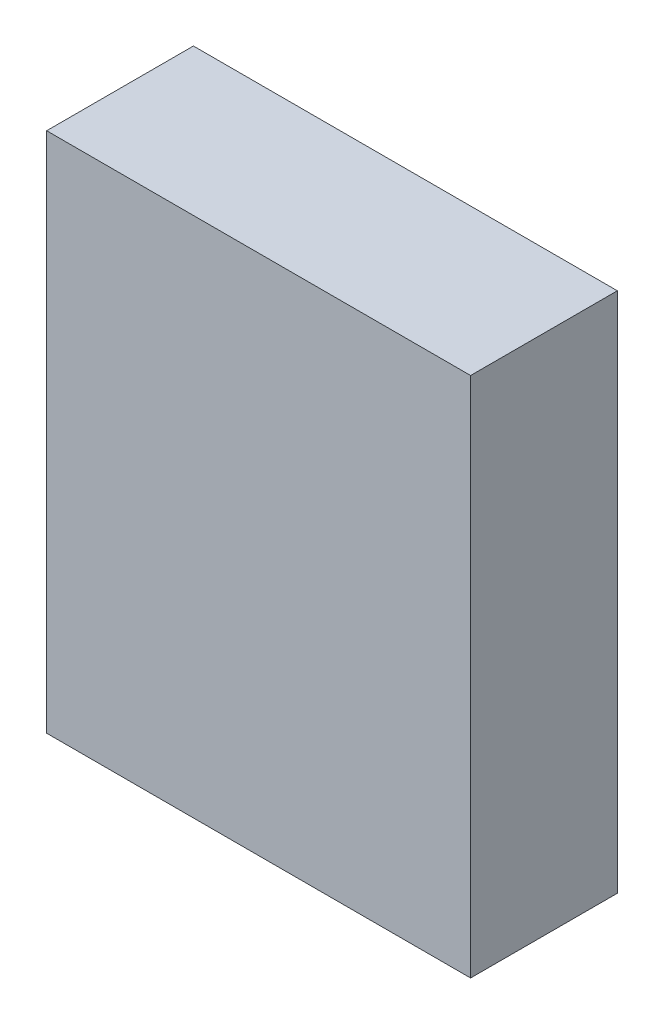
ISO-10303-21;
HEADER;
FILE_DESCRIPTION(('STEP AP214'),'2;1');
FILE_NAME('part.step','',(''),(''),'','','');
FILE_SCHEMA(('AUTOMOTIVE_DESIGN { 1 0 10303 214 1 1 1 1 }'));
ENDSEC;
DATA;
#1=APPLICATION_CONTEXT('core data for automotive mechanical design processes');
#2=APPLICATION_PROTOCOL_DEFINITION('international standard','automotive_design',2000,#1);
#3=PRODUCT_CONTEXT('',#1,'mechanical');
#4=PRODUCT('Part','Part','',(#3));
#5=PRODUCT_RELATED_PRODUCT_CATEGORY('part','',(#4));
#6=PRODUCT_DEFINITION_FORMATION('','',#4);
#7=PRODUCT_DEFINITION_CONTEXT('part definition',#1,'design');
#8=PRODUCT_DEFINITION('design','',#6,#7);
#9=PRODUCT_DEFINITION_SHAPE('','',#8);
#10=(LENGTH_UNIT() NAMED_UNIT(*) SI_UNIT(.MILLI.,.METRE.));
#11=(NAMED_UNIT(*) PLANE_ANGLE_UNIT() SI_UNIT($,.RADIAN.));
#12=(NAMED_UNIT(*) SI_UNIT($,.STERADIAN.) SOLID_ANGLE_UNIT());
#13=UNCERTAINTY_MEASURE_WITH_UNIT(LENGTH_MEASURE(1.E-05),#10,'distance_accuracy_value','');
#14=(GEOMETRIC_REPRESENTATION_CONTEXT(3) GLOBAL_UNCERTAINTY_ASSIGNED_CONTEXT((#13)) GLOBAL_UNIT_ASSIGNED_CONTEXT((#10,
#11,#12)) REPRESENTATION_CONTEXT('',''));
#15=CARTESIAN_POINT('',(0.,0.,0.));
#16=DIRECTION('',(0.,0.,1.));
#17=DIRECTION('',(1.,0.,0.));
#18=AXIS2_PLACEMENT_3D('',#15,#16,#17);
#19=CARTESIAN_POINT('',(0.,0.,9.));
#20=DIRECTION('',(1.,0.,0.));
#21=DIRECTION('',(0.,0.,-1.));
#22=AXIS2_PLACEMENT_3D('',#19,#20,#21);
#23=PLANE('',#22);
#24=DIRECTION('',(0.,-1.,0.));
#25=VECTOR('',#24,1.);
#26=CARTESIAN_POINT('',(0.,0.,0.));
#27=LINE('',#26,#25);
#28=CARTESIAN_POINT('',(0.,0.,0.));
#29=VERTEX_POINT('',#28);
#30=CARTESIAN_POINT('',(0.,-32.,0.));
#31=VERTEX_POINT('',#30);
#32=EDGE_CURVE('E110',#29,#31,#27,.T.);
#33=ORIENTED_EDGE('',*,*,#32,.T.);
#34=DIRECTION('',(0.,0.,-1.));
#35=VECTOR('',#34,1.);
#36=CARTESIAN_POINT('',(0.,-32.,9.));
#37=LINE('',#36,#35);
#38=CARTESIAN_POINT('',(0.,-32.,9.));
#39=VERTEX_POINT('',#38);
#40=EDGE_CURVE('E11',#39,#31,#37,.T.);
#41=ORIENTED_EDGE('',*,*,#40,.F.);
#42=DIRECTION('',(0.,-1.,0.));
#43=VECTOR('',#42,1.);
#44=CARTESIAN_POINT('',(0.,0.,9.));
#45=LINE('',#44,#43);
#46=CARTESIAN_POINT('',(0.,0.,9.));
#47=VERTEX_POINT('',#46);
#48=EDGE_CURVE('E94',#47,#39,#45,.T.);
#49=ORIENTED_EDGE('',*,*,#48,.F.);
#50=DIRECTION('',(0.,0.,-1.));
#51=VECTOR('',#50,1.);
#52=CARTESIAN_POINT('',(0.,0.,9.));
#53=LINE('',#52,#51);
#54=EDGE_CURVE('E106',#47,#29,#53,.T.);
#55=ORIENTED_EDGE('',*,*,#54,.T.);
#56=EDGE_LOOP('',(#33,#41,#49,#55));
#57=FACE_BOUND('',#56,.T.);
#58=ADVANCED_FACE('F42',(#57),#23,.F.);
#59=CARTESIAN_POINT('',(0.,-32.,9.));
#60=DIRECTION('',(0.,1.,0.));
#61=DIRECTION('',(0.,0.,1.));
#62=AXIS2_PLACEMENT_3D('',#59,#60,#61);
#63=PLANE('',#62);
#64=DIRECTION('',(1.,0.,0.));
#65=VECTOR('',#64,1.);
#66=CARTESIAN_POINT('',(0.,-32.,0.));
#67=LINE('',#66,#65);
#68=CARTESIAN_POINT('',(26.,-32.,0.));
#69=VERTEX_POINT('',#68);
#70=EDGE_CURVE('E99',#31,#69,#67,.T.);
#71=ORIENTED_EDGE('',*,*,#70,.T.);
#72=DIRECTION('',(0.,0.,-1.));
#73=VECTOR('',#72,1.);
#74=CARTESIAN_POINT('',(26.,-32.,9.));
#75=LINE('',#74,#73);
#76=CARTESIAN_POINT('',(26.,-32.,9.));
#77=VERTEX_POINT('',#76);
#78=EDGE_CURVE('E51',#77,#69,#75,.T.);
#79=ORIENTED_EDGE('',*,*,#78,.F.);
#80=DIRECTION('',(1.,0.,0.));
#81=VECTOR('',#80,1.);
#82=CARTESIAN_POINT('',(0.,-32.,9.));
#83=LINE('',#82,#81);
#84=EDGE_CURVE('E89',#39,#77,#83,.T.);
#85=ORIENTED_EDGE('',*,*,#84,.F.);
#86=ORIENTED_EDGE('',*,*,#40,.T.);
#87=EDGE_LOOP('',(#71,#79,#85,#86));
#88=FACE_BOUND('',#87,.T.);
#89=ADVANCED_FACE('F98',(#88),#63,.F.);
#90=CARTESIAN_POINT('',(26.,0.,9.));
#91=DIRECTION('',(-1.,0.,0.));
#92=DIRECTION('',(0.,0.,1.));
#93=AXIS2_PLACEMENT_3D('',#90,#91,#92);
#94=PLANE('',#93);
#95=DIRECTION('',(0.,1.,0.));
#96=VECTOR('',#95,1.);
#97=CARTESIAN_POINT('',(26.,0.,0.));
#98=LINE('',#97,#96);
#99=CARTESIAN_POINT('',(26.,0.,0.));
#100=VERTEX_POINT('',#99);
#101=EDGE_CURVE('E76',#69,#100,#98,.T.);
#102=ORIENTED_EDGE('',*,*,#101,.T.);
#103=DIRECTION('',(0.,0.,-1.));
#104=VECTOR('',#103,1.);
#105=CARTESIAN_POINT('',(26.,0.,9.));
#106=LINE('',#105,#104);
#107=CARTESIAN_POINT('',(26.,0.,9.));
#108=VERTEX_POINT('',#107);
#109=EDGE_CURVE('E101',#108,#100,#106,.T.);
#110=ORIENTED_EDGE('',*,*,#109,.F.);
#111=DIRECTION('',(0.,1.,0.));
#112=VECTOR('',#111,1.);
#113=CARTESIAN_POINT('',(26.,0.,9.));
#114=LINE('',#113,#112);
#115=EDGE_CURVE('E92',#77,#108,#114,.T.);
#116=ORIENTED_EDGE('',*,*,#115,.F.);
#117=ORIENTED_EDGE('',*,*,#78,.T.);
#118=EDGE_LOOP('',(#102,#110,#116,#117));
#119=FACE_BOUND('',#118,.T.);
#120=ADVANCED_FACE('F102',(#119),#94,.F.);
#121=CARTESIAN_POINT('',(0.,0.,9.));
#122=DIRECTION('',(0.,-1.,0.));
#123=DIRECTION('',(0.,0.,-1.));
#124=AXIS2_PLACEMENT_3D('',#121,#122,#123);
#125=PLANE('',#124);
#126=DIRECTION('',(-1.,0.,0.));
#127=VECTOR('',#126,1.);
#128=CARTESIAN_POINT('',(0.,0.,0.));
#129=LINE('',#128,#127);
#130=EDGE_CURVE('E82',#100,#29,#129,.T.);
#131=ORIENTED_EDGE('',*,*,#130,.T.);
#132=ORIENTED_EDGE('',*,*,#54,.F.);
#133=DIRECTION('',(-1.,0.,0.));
#134=VECTOR('',#133,1.);
#135=CARTESIAN_POINT('',(0.,0.,9.));
#136=LINE('',#135,#134);
#137=EDGE_CURVE('E59',#108,#47,#136,.T.);
#138=ORIENTED_EDGE('',*,*,#137,.F.);
#139=ORIENTED_EDGE('',*,*,#109,.T.);
#140=EDGE_LOOP('',(#131,#132,#138,#139));
#141=FACE_BOUND('',#140,.T.);
#142=ADVANCED_FACE('F123',(#141),#125,.F.);
#143=CARTESIAN_POINT('',(0.,0.,9.));
#144=DIRECTION('',(0.,0.,1.));
#145=DIRECTION('',(1.,0.,0.));
#146=AXIS2_PLACEMENT_3D('',#143,#144,#145);
#147=PLANE('',#146);
#148=ORIENTED_EDGE('',*,*,#48,.T.);
#149=ORIENTED_EDGE('',*,*,#84,.T.);
#150=ORIENTED_EDGE('',*,*,#115,.T.);
#151=ORIENTED_EDGE('',*,*,#137,.T.);
#152=EDGE_LOOP('',(#148,#149,#150,#151));
#153=FACE_BOUND('',#152,.T.);
#154=ADVANCED_FACE('F90',(#153),#147,.T.);
#155=CARTESIAN_POINT('',(0.,0.,0.));
#156=DIRECTION('',(0.,0.,1.));
#157=DIRECTION('',(1.,0.,0.));
#158=AXIS2_PLACEMENT_3D('',#155,#156,#157);
#159=PLANE('',#158);
#160=ORIENTED_EDGE('',*,*,#32,.F.);
#161=ORIENTED_EDGE('',*,*,#130,.F.);
#162=ORIENTED_EDGE('',*,*,#101,.F.);
#163=ORIENTED_EDGE('',*,*,#70,.F.);
#164=EDGE_LOOP('',(#160,#161,#162,#163));
#165=FACE_BOUND('',#164,.T.);
#166=ADVANCED_FACE('F126',(#165),#159,.F.);
#167=CLOSED_SHELL('',(#58,#89,#120,#142,#154,#166));
#168=MANIFOLD_SOLID_BREP('B2',#167);
#169=ADVANCED_BREP_SHAPE_REPRESENTATION('',(#18,#168),#14);
#170=SHAPE_DEFINITION_REPRESENTATION(#9,#169);
ENDSEC;
END-ISO-10303-21;
